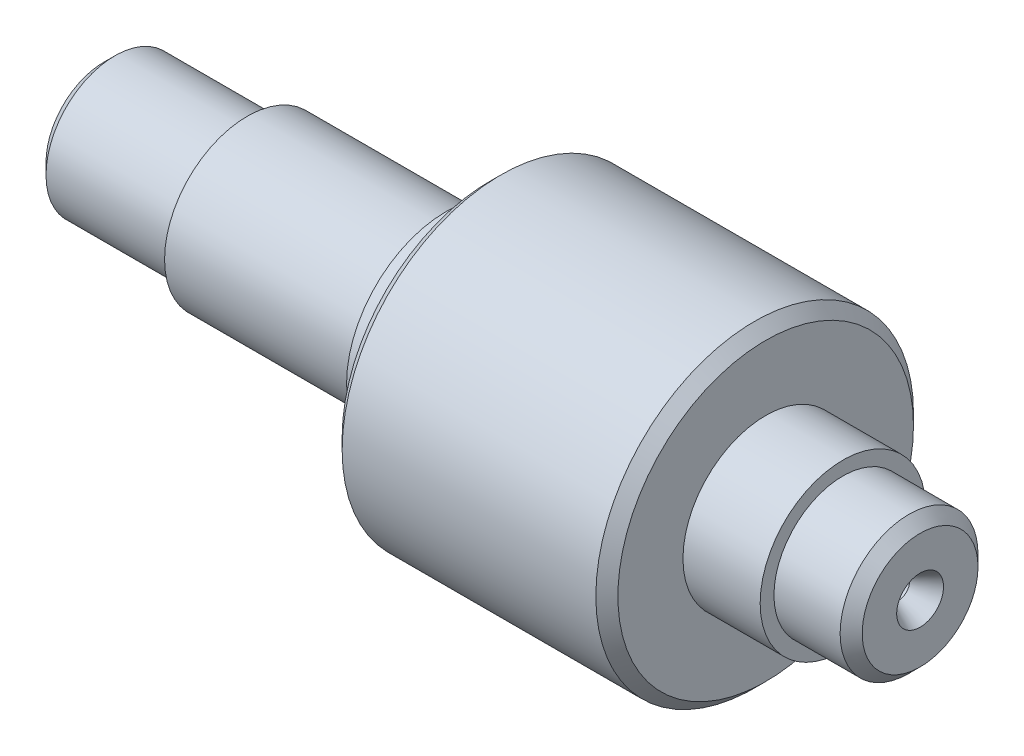
ISO-10303-21;
HEADER;
FILE_DESCRIPTION(('STEP AP214'),'2;1');
FILE_NAME('part.step','',(''),(''),'','','');
FILE_SCHEMA(('AUTOMOTIVE_DESIGN { 1 0 10303 214 1 1 1 1 }'));
ENDSEC;
DATA;
#1=APPLICATION_CONTEXT('core data for automotive mechanical design processes');
#2=APPLICATION_PROTOCOL_DEFINITION('international standard','automotive_design',2000,#1);
#3=PRODUCT_CONTEXT('',#1,'mechanical');
#4=PRODUCT('Part','Part','',(#3));
#5=PRODUCT_RELATED_PRODUCT_CATEGORY('part','',(#4));
#6=PRODUCT_DEFINITION_FORMATION('','',#4);
#7=PRODUCT_DEFINITION_CONTEXT('part definition',#1,'design');
#8=PRODUCT_DEFINITION('design','',#6,#7);
#9=PRODUCT_DEFINITION_SHAPE('','',#8);
#10=(LENGTH_UNIT() NAMED_UNIT(*) SI_UNIT(.MILLI.,.METRE.));
#11=(NAMED_UNIT(*) PLANE_ANGLE_UNIT() SI_UNIT($,.RADIAN.));
#12=(NAMED_UNIT(*) SI_UNIT($,.STERADIAN.) SOLID_ANGLE_UNIT());
#13=UNCERTAINTY_MEASURE_WITH_UNIT(LENGTH_MEASURE(1.E-05),#10,'distance_accuracy_value','');
#14=(GEOMETRIC_REPRESENTATION_CONTEXT(3) GLOBAL_UNCERTAINTY_ASSIGNED_CONTEXT((#13)) GLOBAL_UNIT_ASSIGNED_CONTEXT((#10,
#11,#12)) REPRESENTATION_CONTEXT('',''));
#15=CARTESIAN_POINT('',(0.,0.,0.));
#16=DIRECTION('',(0.,0.,1.));
#17=DIRECTION('',(1.,0.,0.));
#18=AXIS2_PLACEMENT_3D('',#15,#16,#17);
#19=CARTESIAN_POINT('',(0.,-12.5,0.));
#20=DIRECTION('',(-1.,0.,0.));
#21=DIRECTION('',(0.,0.,1.));
#22=AXIS2_PLACEMENT_3D('',#19,#20,#21);
#23=PLANE('',#22);
#24=CARTESIAN_POINT('',(0.,0.,0.));
#25=DIRECTION('',(-1.,0.,0.));
#26=DIRECTION('',(0.,0.,1.));
#27=AXIS2_PLACEMENT_3D('',#24,#25,#26);
#28=CIRCLE('',#27,10.5);
#29=CARTESIAN_POINT('',(0.,0.,10.5));
#30=VERTEX_POINT('',#29);
#31=EDGE_CURVE('E219',#30,#30,#28,.T.);
#32=ORIENTED_EDGE('',*,*,#31,.T.);
#33=EDGE_LOOP('',(#32));
#34=FACE_BOUND('',#33,.T.);
#35=CARTESIAN_POINT('',(0.,0.,0.));
#36=DIRECTION('',(-1.,0.,0.));
#37=DIRECTION('',(0.,0.,1.));
#38=AXIS2_PLACEMENT_3D('',#35,#36,#37);
#39=CIRCLE('',#38,4.25);
#40=CARTESIAN_POINT('',(0.,0.,4.25));
#41=VERTEX_POINT('',#40);
#42=EDGE_CURVE('E136',#41,#41,#39,.T.);
#43=ORIENTED_EDGE('',*,*,#42,.F.);
#44=EDGE_LOOP('',(#43));
#45=FACE_BOUND('',#44,.T.);
#46=ADVANCED_FACE('F40',(#34,#45),#23,.T.);
#47=CARTESIAN_POINT('',(148.,0.,0.));
#48=DIRECTION('',(1.,0.,0.));
#49=DIRECTION('',(0.,0.,-1.));
#50=AXIS2_PLACEMENT_3D('',#47,#48,#49);
#51=PLANE('',#50);
#52=CARTESIAN_POINT('',(148.,0.,0.));
#53=DIRECTION('',(1.,0.,0.));
#54=DIRECTION('',(0.,0.,-1.));
#55=AXIS2_PLACEMENT_3D('',#52,#53,#54);
#56=CIRCLE('',#55,10.5);
#57=CARTESIAN_POINT('',(148.,0.,-10.5));
#58=VERTEX_POINT('',#57);
#59=EDGE_CURVE('E11',#58,#58,#56,.T.);
#60=ORIENTED_EDGE('',*,*,#59,.T.);
#61=EDGE_LOOP('',(#60));
#62=FACE_BOUND('',#61,.T.);
#63=CARTESIAN_POINT('',(148.,0.,0.));
#64=DIRECTION('',(-1.,0.,0.));
#65=DIRECTION('',(0.,0.,1.));
#66=AXIS2_PLACEMENT_3D('',#63,#64,#65);
#67=CIRCLE('',#66,4.25);
#68=CARTESIAN_POINT('',(148.,0.,4.25));
#69=VERTEX_POINT('',#68);
#70=EDGE_CURVE('E119',#69,#69,#67,.T.);
#71=ORIENTED_EDGE('',*,*,#70,.T.);
#72=EDGE_LOOP('',(#71));
#73=FACE_BOUND('',#72,.T.);
#74=ADVANCED_FACE('F259',(#62,#73),#51,.T.);
#75=CARTESIAN_POINT('',(0.,0.,0.));
#76=DIRECTION('',(-1.,0.,0.));
#77=DIRECTION('',(0.,0.,1.));
#78=AXIS2_PLACEMENT_3D('',#75,#76,#77);
#79=CYLINDRICAL_SURFACE('',#78,12.5);
#80=CARTESIAN_POINT('',(146.,0.,0.));
#81=DIRECTION('',(1.,0.,0.));
#82=DIRECTION('',(0.,0.,-1.));
#83=AXIS2_PLACEMENT_3D('',#80,#81,#82);
#84=CIRCLE('',#83,12.5);
#85=CARTESIAN_POINT('',(146.,0.,-12.5));
#86=VERTEX_POINT('',#85);
#87=EDGE_CURVE('E50',#86,#86,#84,.F.);
#88=ORIENTED_EDGE('',*,*,#87,.T.);
#89=EDGE_LOOP('',(#88));
#90=FACE_BOUND('',#89,.T.);
#91=CARTESIAN_POINT('',(134.,0.,0.));
#92=DIRECTION('',(-1.,0.,0.));
#93=DIRECTION('',(0.,0.,1.));
#94=AXIS2_PLACEMENT_3D('',#91,#92,#93);
#95=CIRCLE('',#94,12.5);
#96=CARTESIAN_POINT('',(134.,0.,12.5));
#97=VERTEX_POINT('',#96);
#98=EDGE_CURVE('E176',#97,#97,#95,.T.);
#99=ORIENTED_EDGE('',*,*,#98,.F.);
#100=EDGE_LOOP('',(#99));
#101=FACE_BOUND('',#100,.T.);
#102=ADVANCED_FACE('F246',(#90,#101),#79,.T.);
#103=CARTESIAN_POINT('',(134.,-12.5,0.));
#104=DIRECTION('',(1.,0.,0.));
#105=DIRECTION('',(0.,0.,-1.));
#106=AXIS2_PLACEMENT_3D('',#103,#104,#105);
#107=PLANE('',#106);
#108=ORIENTED_EDGE('',*,*,#98,.T.);
#109=EDGE_LOOP('',(#108));
#110=FACE_BOUND('',#109,.T.);
#111=CARTESIAN_POINT('',(134.,0.,0.));
#112=DIRECTION('',(-1.,0.,0.));
#113=DIRECTION('',(0.,0.,1.));
#114=AXIS2_PLACEMENT_3D('',#111,#112,#113);
#115=CIRCLE('',#114,15.);
#116=CARTESIAN_POINT('',(134.,0.,15.));
#117=VERTEX_POINT('',#116);
#118=EDGE_CURVE('E172',#117,#117,#115,.T.);
#119=ORIENTED_EDGE('',*,*,#118,.F.);
#120=EDGE_LOOP('',(#119));
#121=FACE_BOUND('',#120,.T.);
#122=ADVANCED_FACE('F445',(#110,#121),#107,.T.);
#123=CARTESIAN_POINT('',(0.,0.,0.));
#124=DIRECTION('',(-1.,0.,0.));
#125=DIRECTION('',(0.,0.,1.));
#126=AXIS2_PLACEMENT_3D('',#123,#124,#125);
#127=CYLINDRICAL_SURFACE('',#126,15.);
#128=ORIENTED_EDGE('',*,*,#118,.T.);
#129=EDGE_LOOP('',(#128));
#130=FACE_BOUND('',#129,.T.);
#131=CARTESIAN_POINT('',(120.,0.,0.));
#132=DIRECTION('',(-1.,0.,0.));
#133=DIRECTION('',(0.,0.,1.));
#134=AXIS2_PLACEMENT_3D('',#131,#132,#133);
#135=CIRCLE('',#134,15.);
#136=CARTESIAN_POINT('',(120.,0.,15.));
#137=VERTEX_POINT('',#136);
#138=EDGE_CURVE('E168',#137,#137,#135,.T.);
#139=ORIENTED_EDGE('',*,*,#138,.F.);
#140=EDGE_LOOP('',(#139));
#141=FACE_BOUND('',#140,.T.);
#142=ADVANCED_FACE('F433',(#130,#141),#127,.T.);
#143=CARTESIAN_POINT('',(120.,-15.,0.));
#144=DIRECTION('',(1.,0.,0.));
#145=DIRECTION('',(0.,0.,-1.));
#146=AXIS2_PLACEMENT_3D('',#143,#144,#145);
#147=PLANE('',#146);
#148=CARTESIAN_POINT('',(120.,0.,0.));
#149=DIRECTION('',(1.,0.,0.));
#150=DIRECTION('',(0.,0.,-1.));
#151=AXIS2_PLACEMENT_3D('',#148,#149,#150);
#152=CIRCLE('',#151,26.8);
#153=CARTESIAN_POINT('',(120.,0.,-26.8));
#154=VERTEX_POINT('',#153);
#155=EDGE_CURVE('E239',#154,#154,#152,.T.);
#156=ORIENTED_EDGE('',*,*,#155,.T.);
#157=EDGE_LOOP('',(#156));
#158=FACE_BOUND('',#157,.T.);
#159=ORIENTED_EDGE('',*,*,#138,.T.);
#160=EDGE_LOOP('',(#159));
#161=FACE_BOUND('',#160,.T.);
#162=ADVANCED_FACE('F423',(#158,#161),#147,.T.);
#163=CARTESIAN_POINT('',(0.,0.,0.));
#164=DIRECTION('',(-1.,0.,0.));
#165=DIRECTION('',(0.,0.,1.));
#166=AXIS2_PLACEMENT_3D('',#163,#164,#165);
#167=CYLINDRICAL_SURFACE('',#166,28.8);
#168=CARTESIAN_POINT('',(72.,0.,0.));
#169=DIRECTION('',(-1.,0.,0.));
#170=DIRECTION('',(0.,0.,1.));
#171=AXIS2_PLACEMENT_3D('',#168,#169,#170);
#172=CIRCLE('',#171,28.8);
#173=CARTESIAN_POINT('',(72.,0.,28.8));
#174=VERTEX_POINT('',#173);
#175=EDGE_CURVE('E235',#174,#174,#172,.F.);
#176=ORIENTED_EDGE('',*,*,#175,.T.);
#177=EDGE_LOOP('',(#176));
#178=FACE_BOUND('',#177,.T.);
#179=CARTESIAN_POINT('',(118.,0.,0.));
#180=DIRECTION('',(1.,0.,0.));
#181=DIRECTION('',(0.,0.,-1.));
#182=AXIS2_PLACEMENT_3D('',#179,#180,#181);
#183=CIRCLE('',#182,28.8);
#184=CARTESIAN_POINT('',(118.,0.,-28.8));
#185=VERTEX_POINT('',#184);
#186=EDGE_CURVE('E231',#185,#185,#183,.F.);
#187=ORIENTED_EDGE('',*,*,#186,.T.);
#188=EDGE_LOOP('',(#187));
#189=FACE_BOUND('',#188,.T.);
#190=ADVANCED_FACE('F297',(#178,#189),#167,.T.);
#191=CARTESIAN_POINT('',(70.,-28.8,0.));
#192=DIRECTION('',(-1.,0.,0.));
#193=DIRECTION('',(0.,0.,1.));
#194=AXIS2_PLACEMENT_3D('',#191,#192,#193);
#195=PLANE('',#194);
#196=CARTESIAN_POINT('',(70.,0.,0.));
#197=DIRECTION('',(-1.,0.,0.));
#198=DIRECTION('',(0.,0.,1.));
#199=AXIS2_PLACEMENT_3D('',#196,#197,#198);
#200=CIRCLE('',#199,26.8);
#201=CARTESIAN_POINT('',(70.,0.,26.8));
#202=VERTEX_POINT('',#201);
#203=EDGE_CURVE('E227',#202,#202,#200,.T.);
#204=ORIENTED_EDGE('',*,*,#203,.T.);
#205=EDGE_LOOP('',(#204));
#206=FACE_BOUND('',#205,.T.);
#207=CARTESIAN_POINT('',(70.,0.,0.));
#208=DIRECTION('',(-1.,0.,0.));
#209=DIRECTION('',(0.,0.,1.));
#210=AXIS2_PLACEMENT_3D('',#207,#208,#209);
#211=CIRCLE('',#210,18.);
#212=CARTESIAN_POINT('',(70.,0.,18.));
#213=VERTEX_POINT('',#212);
#214=EDGE_CURVE('E164',#213,#213,#211,.T.);
#215=ORIENTED_EDGE('',*,*,#214,.F.);
#216=EDGE_LOOP('',(#215));
#217=FACE_BOUND('',#216,.T.);
#218=ADVANCED_FACE('F293',(#206,#217),#195,.T.);
#219=CARTESIAN_POINT('',(0.,0.,0.));
#220=DIRECTION('',(-1.,0.,0.));
#221=DIRECTION('',(0.,0.,1.));
#222=AXIS2_PLACEMENT_3D('',#219,#220,#221);
#223=CYLINDRICAL_SURFACE('',#222,18.);
#224=ORIENTED_EDGE('',*,*,#214,.T.);
#225=EDGE_LOOP('',(#224));
#226=FACE_BOUND('',#225,.T.);
#227=CARTESIAN_POINT('',(62.,0.,0.));
#228=DIRECTION('',(-1.,0.,0.));
#229=DIRECTION('',(0.,0.,1.));
#230=AXIS2_PLACEMENT_3D('',#227,#228,#229);
#231=CIRCLE('',#230,18.);
#232=CARTESIAN_POINT('',(62.,0.,18.));
#233=VERTEX_POINT('',#232);
#234=EDGE_CURVE('E160',#233,#233,#231,.T.);
#235=ORIENTED_EDGE('',*,*,#234,.F.);
#236=EDGE_LOOP('',(#235));
#237=FACE_BOUND('',#236,.T.);
#238=ADVANCED_FACE('F296',(#226,#237),#223,.T.);
#239=CARTESIAN_POINT('',(62.,-18.,0.));
#240=DIRECTION('',(-1.,0.,0.));
#241=DIRECTION('',(0.,0.,1.));
#242=AXIS2_PLACEMENT_3D('',#239,#240,#241);
#243=PLANE('',#242);
#244=ORIENTED_EDGE('',*,*,#234,.T.);
#245=EDGE_LOOP('',(#244));
#246=FACE_BOUND('',#245,.T.);
#247=CARTESIAN_POINT('',(62.,0.,0.));
#248=DIRECTION('',(-1.,0.,0.));
#249=DIRECTION('',(0.,0.,1.));
#250=AXIS2_PLACEMENT_3D('',#247,#248,#249);
#251=CIRCLE('',#250,15.);
#252=CARTESIAN_POINT('',(62.,0.,15.));
#253=VERTEX_POINT('',#252);
#254=EDGE_CURVE('E156',#253,#253,#251,.T.);
#255=ORIENTED_EDGE('',*,*,#254,.F.);
#256=EDGE_LOOP('',(#255));
#257=FACE_BOUND('',#256,.T.);
#258=ADVANCED_FACE('F303',(#246,#257),#243,.T.);
#259=CARTESIAN_POINT('',(0.,0.,0.));
#260=DIRECTION('',(-1.,0.,0.));
#261=DIRECTION('',(0.,0.,1.));
#262=AXIS2_PLACEMENT_3D('',#259,#260,#261);
#263=CYLINDRICAL_SURFACE('',#262,15.);
#264=CARTESIAN_POINT('',(37.,-4.,-14.456832294801));
#265=CARTESIAN_POINT('',(36.8896417565959,-4.00001309389174,-14.4568189842467));
#266=CARTESIAN_POINT('',(36.7792914780071,-3.99543311151603,-14.4580956467717));
#267=CARTESIAN_POINT('',(36.5594213460339,-3.97718874589725,-14.4631301353517));
#268=CARTESIAN_POINT('',(36.4499013422403,-3.96352604983924,-14.4668875005959));
#269=CARTESIAN_POINT('',(36.232698346486,-3.92725695741263,-14.4767740441059));
#270=CARTESIAN_POINT('',(36.1250119121517,-3.90466984692446,-14.482898107258));
#271=CARTESIAN_POINT('',(35.9120251396443,-3.85076543838184,-14.4973231400467));
#272=CARTESIAN_POINT('',(35.8067248434147,-3.81944798699437,-14.5056241479174));
#273=CARTESIAN_POINT('',(35.4955365812247,-3.71275643853686,-14.5334412456827));
#274=CARTESIAN_POINT('',(35.2941250664526,-3.62460332607936,-14.5558829598252));
#275=CARTESIAN_POINT('',(34.9089792403742,-3.4169578047582,-14.6060171290377));
#276=CARTESIAN_POINT('',(34.7252507960276,-3.29745504324306,-14.6337113178035));
#277=CARTESIAN_POINT('',(34.3760294230722,-3.0273032087801,-14.6920016406366));
#278=CARTESIAN_POINT('',(34.2110381590343,-2.87601544465619,-14.7226489452442));
#279=CARTESIAN_POINT('',(33.9084424330384,-2.54795832924029,-14.7829523618628));
#280=CARTESIAN_POINT('',(33.7708424171316,-2.37118484921249,-14.8126083123117));
#281=CARTESIAN_POINT('',(33.5248278698145,-1.99367199592156,-14.8681604116921));
#282=CARTESIAN_POINT('',(33.4169160344217,-1.79259414843396,-14.8939887414057));
#283=CARTESIAN_POINT('',(33.2366271110387,-1.37435575552791,-14.9383834129136));
#284=CARTESIAN_POINT('',(33.1642423552231,-1.15719869214847,-14.9569513215518));
#285=CARTESIAN_POINT('',(33.0586901748307,-0.718234307369676,-14.9843709217852));
#286=CARTESIAN_POINT('',(33.0246627871064,-0.496647293428111,-14.9934353394138));
#287=CARTESIAN_POINT('',(32.994085686777,-0.0507319917605809,-15.0015705103632));
#288=CARTESIAN_POINT('',(32.9975305158075,0.173595891963453,-15.0006427191926));
#289=CARTESIAN_POINT('',(33.0411956863681,0.612629502642169,-14.9890534931377));
#290=CARTESIAN_POINT('',(33.0804861276563,0.827435206418323,-14.9786381919443));
#291=CARTESIAN_POINT('',(33.1932251508632,1.24728467665105,-14.9495347795913));
#292=CARTESIAN_POINT('',(33.2666753521507,1.45232797980575,-14.9308462762364));
#293=CARTESIAN_POINT('',(33.4463599662528,1.84920963545355,-14.8869312076945));
#294=CARTESIAN_POINT('',(33.5529133722298,2.04089626466617,-14.8616414267933));
#295=CARTESIAN_POINT('',(33.7955427689646,2.40398441957148,-14.8072486052897));
#296=CARTESIAN_POINT('',(33.9316239221831,2.5753823900035,-14.7781448982353));
#297=CARTESIAN_POINT('',(34.2343279711014,2.8985493503678,-14.7182294237973));
#298=CARTESIAN_POINT('',(34.4017580078943,3.04955722400809,-14.6873926412644));
#299=CARTESIAN_POINT('',(34.7600428407092,3.32161448391783,-14.6282716207252));
#300=CARTESIAN_POINT('',(34.9509040964812,3.4426555807802,-14.5999880903709));
#301=CARTESIAN_POINT('',(35.2513532833646,3.59932937334133,-14.5618587427771));
#302=CARTESIAN_POINT('',(35.354288915041,3.64754371945348,-14.5498268172621));
#303=CARTESIAN_POINT('',(35.5640463212715,3.73509417643326,-14.5275984074125));
#304=CARTESIAN_POINT('',(35.6708665124627,3.77443385857864,-14.5174011851057));
#305=CARTESIAN_POINT('',(35.8875194192202,3.843867838105,-14.4991713081511));
#306=CARTESIAN_POINT('',(35.997348878193,3.87397173088604,-14.4911364080612));
#307=CARTESIAN_POINT('',(36.2192752211249,3.92471856960774,-14.4774747012191));
#308=CARTESIAN_POINT('',(36.33137102282,3.9453659249532,-14.4718467722231));
#309=CARTESIAN_POINT('',(36.536251024718,3.97411378733402,-14.4639761334309));
#310=CARTESIAN_POINT('',(36.6287964461673,3.98382319960777,-14.4613012625133));
#311=CARTESIAN_POINT('',(36.8142253533099,3.99676420153356,-14.4577275048596));
#312=CARTESIAN_POINT('',(36.9071080704325,4.00000603663184,-14.4568258092259));
#313=CARTESIAN_POINT('',(37.,4.,-14.456832294801));
#314=B_SPLINE_CURVE_WITH_KNOTS('',3,(#264,#265,#266,#267,#268,#269,#270,#271,#272,#273,#274,
#275,#276,#277,#278,#279,#280,#281,#282,#283,#284,#285,#286,#287,#288,#289,#290,#291,#292,#293,
#294,#295,#296,#297,#298,#299,#300,#301,#302,#303,#304,#305,#306,#307,#308,#309,#310,#311,#312,
#313),.UNSPECIFIED.,.F.,.F.,(4,2,2,2,2,2,2,2,2,2,2,2,2,2,2,2,2,2,2,2,2,2,2,2,4),(0.,
0.330958670878044,0.66185588076851,0.992041890688588,1.32223370010825,1.98190700187181,
2.64179842357632,3.3164963753615,3.99130375261118,4.67691814590523,5.3623844975935,
6.03215661862343,6.7018311790669,7.35461236515045,8.00742449996358,8.66673340793703,
9.32615767867957,10.0057598785669,10.6855498604333,11.0281077435251,11.3705275300852,
11.7125903499582,12.0544935096114,12.3335333037377,12.6121307120356),.UNSPECIFIED.);
#315=CARTESIAN_POINT('',(37.,-4.,-14.456832294801));
#316=VERTEX_POINT('',#315);
#317=CARTESIAN_POINT('',(37.,4.,-14.456832294801));
#318=VERTEX_POINT('',#317);
#319=EDGE_CURVE('E212',#316,#318,#314,.T.);
#320=ORIENTED_EDGE('',*,*,#319,.F.);
#321=DIRECTION('',(-1.,0.,0.));
#322=VECTOR('',#321,1.);
#323=CARTESIAN_POINT('',(0.,-4.00000000000001,-14.456832294801));
#324=LINE('',#323,#322);
#325=CARTESIAN_POINT('',(51.,-4.00000000000001,-14.456832294801));
#326=VERTEX_POINT('',#325);
#327=EDGE_CURVE('E89',#326,#316,#324,.T.);
#328=ORIENTED_EDGE('',*,*,#327,.F.);
#329=CARTESIAN_POINT('',(51.,4.,-14.456832294801));
#330=CARTESIAN_POINT('',(51.1103582434041,4.00001309389174,-14.4568189842467));
#331=CARTESIAN_POINT('',(51.2207085219929,3.99543311151603,-14.4580956467717));
#332=CARTESIAN_POINT('',(51.4405786539661,3.97718874589726,-14.4631301353517));
#333=CARTESIAN_POINT('',(51.5500986577597,3.96352604983924,-14.4668875005959));
#334=CARTESIAN_POINT('',(51.767301653514,3.92725695741263,-14.4767740441058));
#335=CARTESIAN_POINT('',(51.8749880878483,3.90466984692446,-14.482898107258));
#336=CARTESIAN_POINT('',(52.0879748603556,3.85076543838184,-14.4973231400467));
#337=CARTESIAN_POINT('',(52.1932751565853,3.81944798699437,-14.5056241479174));
#338=CARTESIAN_POINT('',(52.5044634187753,3.71275643853687,-14.5334412456827));
#339=CARTESIAN_POINT('',(52.7058749335474,3.62460332607936,-14.5558829598252));
#340=CARTESIAN_POINT('',(53.0910207596258,3.4169578047582,-14.6060171290377));
#341=CARTESIAN_POINT('',(53.2747492039724,3.29745504324307,-14.6337113178035));
#342=CARTESIAN_POINT('',(53.6239705769278,3.0273032087801,-14.6920016406366));
#343=CARTESIAN_POINT('',(53.7889618409657,2.87601544465619,-14.7226489452442));
#344=CARTESIAN_POINT('',(54.0915575669616,2.54795832924029,-14.7829523618628));
#345=CARTESIAN_POINT('',(54.2291575828684,2.37118484921249,-14.8126083123117));
#346=CARTESIAN_POINT('',(54.4751721301854,1.99367199592156,-14.8681604116921));
#347=CARTESIAN_POINT('',(54.5830839655783,1.79259414843397,-14.8939887414057));
#348=CARTESIAN_POINT('',(54.7633728889612,1.37435575552791,-14.9383834129136));
#349=CARTESIAN_POINT('',(54.8357576447769,1.15719869214847,-14.9569513215518));
#350=CARTESIAN_POINT('',(54.9413098251693,0.718234307369679,-14.9843709217852));
#351=CARTESIAN_POINT('',(54.9753372128936,0.496647293428113,-14.9934353394138));
#352=CARTESIAN_POINT('',(55.005914313223,0.050731991760583,-15.0015705103632));
#353=CARTESIAN_POINT('',(55.0024694841925,-0.173595891963451,-15.0006427191926));
#354=CARTESIAN_POINT('',(54.9588043136319,-0.612629502642167,-14.9890534931377));
#355=CARTESIAN_POINT('',(54.9195138723437,-0.827435206418321,-14.9786381919443));
#356=CARTESIAN_POINT('',(54.8067748491367,-1.24728467665105,-14.9495347795913));
#357=CARTESIAN_POINT('',(54.7333246478493,-1.45232797980575,-14.9308462762364));
#358=CARTESIAN_POINT('',(54.5536400337472,-1.84920963545355,-14.8869312076945));
#359=CARTESIAN_POINT('',(54.4470866277702,-2.04089626466617,-14.8616414267933));
#360=CARTESIAN_POINT('',(54.2044572310354,-2.40398441957148,-14.8072486052897));
#361=CARTESIAN_POINT('',(54.0683760778169,-2.5753823900035,-14.7781448982353));
#362=CARTESIAN_POINT('',(53.7656720288986,-2.8985493503678,-14.7182294237973));
#363=CARTESIAN_POINT('',(53.5982419921057,-3.04955722400808,-14.6873926412644));
#364=CARTESIAN_POINT('',(53.2399571592908,-3.32161448391782,-14.6282716207252));
#365=CARTESIAN_POINT('',(53.0490959035188,-3.4426555807802,-14.5999880903709));
#366=CARTESIAN_POINT('',(52.7486467166354,-3.59932937334133,-14.5618587427771));
#367=CARTESIAN_POINT('',(52.645711084959,-3.64754371945347,-14.5498268172621));
#368=CARTESIAN_POINT('',(52.4359536787285,-3.73509417643326,-14.5275984074125));
#369=CARTESIAN_POINT('',(52.3291334875373,-3.77443385857863,-14.5174011851057));
#370=CARTESIAN_POINT('',(52.1124805807798,-3.843867838105,-14.4991713081511));
#371=CARTESIAN_POINT('',(52.002651121807,-3.87397173088603,-14.4911364080612));
#372=CARTESIAN_POINT('',(51.780724778875,-3.92471856960774,-14.4774747012191));
#373=CARTESIAN_POINT('',(51.66862897718,-3.9453659249532,-14.4718467722231));
#374=CARTESIAN_POINT('',(51.463748975282,-3.97411378733402,-14.4639761334309));
#375=CARTESIAN_POINT('',(51.3712035538327,-3.98382319960776,-14.4613012625133));
#376=CARTESIAN_POINT('',(51.1857746466901,-3.99676420153355,-14.4577275048596));
#377=CARTESIAN_POINT('',(51.0928919295675,-4.00000603663183,-14.4568258092259));
#378=CARTESIAN_POINT('',(51.,-4.,-14.456832294801));
#379=B_SPLINE_CURVE_WITH_KNOTS('',3,(#329,#330,#331,#332,#333,#334,#335,#336,#337,#338,#339,
#340,#341,#342,#343,#344,#345,#346,#347,#348,#349,#350,#351,#352,#353,#354,#355,#356,#357,#358,
#359,#360,#361,#362,#363,#364,#365,#366,#367,#368,#369,#370,#371,#372,#373,#374,#375,#376,#377,
#378),.UNSPECIFIED.,.F.,.F.,(4,2,2,2,2,2,2,2,2,2,2,2,2,2,2,2,2,2,2,2,2,2,2,2,4),(0.,
0.330958670878051,0.66185588076851,0.992041890688574,1.32223370010825,1.98190700187181,
2.64179842357632,3.3164963753615,3.99130375261118,4.67691814590523,5.3623844975935,
6.03215661862343,6.7018311790669,7.35461236515045,8.00742449996358,8.66673340793703,
9.32615767867957,10.0057598785669,10.6855498604333,11.0281077435251,11.3705275300852,
11.7125903499582,12.0544935096114,12.3335333037377,12.6121307120356),.UNSPECIFIED.);
#380=CARTESIAN_POINT('',(51.,4.,-14.456832294801));
#381=VERTEX_POINT('',#380);
#382=EDGE_CURVE('E182',#381,#326,#379,.T.);
#383=ORIENTED_EDGE('',*,*,#382,.F.);
#384=DIRECTION('',(-1.,0.,0.));
#385=VECTOR('',#384,1.);
#386=CARTESIAN_POINT('',(0.,3.99999999999999,-14.456832294801));
#387=LINE('',#386,#385);
#388=EDGE_CURVE('E191',#318,#381,#387,.F.);
#389=ORIENTED_EDGE('',*,*,#388,.F.);
#390=EDGE_LOOP('',(#320,#328,#383,#389));
#391=FACE_BOUND('',#390,.T.);
#392=ORIENTED_EDGE('',*,*,#254,.T.);
#393=EDGE_LOOP('',(#392));
#394=FACE_BOUND('',#393,.T.);
#395=CARTESIAN_POINT('',(26.,0.,0.));
#396=DIRECTION('',(-1.,0.,0.));
#397=DIRECTION('',(0.,0.,1.));
#398=AXIS2_PLACEMENT_3D('',#395,#396,#397);
#399=CIRCLE('',#398,15.);
#400=CARTESIAN_POINT('',(26.,0.,15.));
#401=VERTEX_POINT('',#400);
#402=EDGE_CURVE('E152',#401,#401,#399,.T.);
#403=ORIENTED_EDGE('',*,*,#402,.F.);
#404=EDGE_LOOP('',(#403));
#405=FACE_BOUND('',#404,.T.);
#406=ADVANCED_FACE('F193',(#391,#394,#405),#263,.T.);
#407=CARTESIAN_POINT('',(26.,-15.,0.));
#408=DIRECTION('',(-1.,0.,0.));
#409=DIRECTION('',(0.,0.,1.));
#410=AXIS2_PLACEMENT_3D('',#407,#408,#409);
#411=PLANE('',#410);
#412=ORIENTED_EDGE('',*,*,#402,.T.);
#413=EDGE_LOOP('',(#412));
#414=FACE_BOUND('',#413,.T.);
#415=CARTESIAN_POINT('',(26.,0.,0.));
#416=DIRECTION('',(-1.,0.,0.));
#417=DIRECTION('',(0.,0.,1.));
#418=AXIS2_PLACEMENT_3D('',#415,#416,#417);
#419=CIRCLE('',#418,12.5);
#420=CARTESIAN_POINT('',(26.,0.,12.5));
#421=VERTEX_POINT('',#420);
#422=EDGE_CURVE('E148',#421,#421,#419,.T.);
#423=ORIENTED_EDGE('',*,*,#422,.F.);
#424=EDGE_LOOP('',(#423));
#425=FACE_BOUND('',#424,.T.);
#426=ADVANCED_FACE('F313',(#414,#425),#411,.T.);
#427=CARTESIAN_POINT('',(0.,0.,0.));
#428=DIRECTION('',(-1.,0.,0.));
#429=DIRECTION('',(0.,0.,1.));
#430=AXIS2_PLACEMENT_3D('',#427,#428,#429);
#431=CYLINDRICAL_SURFACE('',#430,12.5);
#432=CARTESIAN_POINT('',(2.00000000000001,0.,0.));
#433=DIRECTION('',(-1.,0.,0.));
#434=DIRECTION('',(0.,0.,1.));
#435=AXIS2_PLACEMENT_3D('',#432,#433,#434);
#436=CIRCLE('',#435,12.5);
#437=CARTESIAN_POINT('',(2.00000000000001,0.,12.5));
#438=VERTEX_POINT('',#437);
#439=EDGE_CURVE('E223',#438,#438,#436,.F.);
#440=ORIENTED_EDGE('',*,*,#439,.T.);
#441=EDGE_LOOP('',(#440));
#442=FACE_BOUND('',#441,.T.);
#443=ORIENTED_EDGE('',*,*,#422,.T.);
#444=EDGE_LOOP('',(#443));
#445=FACE_BOUND('',#444,.T.);
#446=ADVANCED_FACE('F319',(#442,#445),#431,.T.);
#447=CARTESIAN_POINT('',(10.0547005383793,0.,0.));
#448=DIRECTION('',(-1.,0.,0.));
#449=DIRECTION('',(0.,0.,1.));
#450=AXIS2_PLACEMENT_3D('',#447,#448,#449);
#451=CONICAL_SURFACE('',#450,0.,1.04719755119659);
#452=CARTESIAN_POINT('',(8.9,0.,0.));
#453=DIRECTION('',(-1.,0.,0.));
#454=DIRECTION('',(0.,0.,1.));
#455=AXIS2_PLACEMENT_3D('',#452,#453,#454);
#456=CIRCLE('',#455,2.);
#457=CARTESIAN_POINT('',(8.9,0.,2.));
#458=VERTEX_POINT('',#457);
#459=EDGE_CURVE('E144',#458,#458,#456,.T.);
#460=ORIENTED_EDGE('',*,*,#459,.T.);
#461=EDGE_LOOP('',(#460));
#462=FACE_BOUND('',#461,.T.);
#463=CARTESIAN_POINT('',(10.0547005383793,0.,0.));
#464=VERTEX_POINT('',#463);
#465=VERTEX_LOOP('',#464);
#466=FACE_BOUND('',#465,.T.);
#467=ADVANCED_FACE('F323',(#462,#466),#451,.F.);
#468=CARTESIAN_POINT('',(0.,0.,0.));
#469=DIRECTION('',(-1.,0.,0.));
#470=DIRECTION('',(0.,0.,1.));
#471=AXIS2_PLACEMENT_3D('',#468,#469,#470);
#472=CYLINDRICAL_SURFACE('',#471,2.);
#473=CARTESIAN_POINT('',(3.9,0.,0.));
#474=DIRECTION('',(-1.,0.,0.));
#475=DIRECTION('',(0.,0.,1.));
#476=AXIS2_PLACEMENT_3D('',#473,#474,#475);
#477=CIRCLE('',#476,2.);
#478=CARTESIAN_POINT('',(3.9,0.,2.));
#479=VERTEX_POINT('',#478);
#480=EDGE_CURVE('E140',#479,#479,#477,.T.);
#481=ORIENTED_EDGE('',*,*,#480,.T.);
#482=EDGE_LOOP('',(#481));
#483=FACE_BOUND('',#482,.T.);
#484=ORIENTED_EDGE('',*,*,#459,.F.);
#485=EDGE_LOOP('',(#484));
#486=FACE_BOUND('',#485,.T.);
#487=ADVANCED_FACE('F329',(#483,#486),#472,.F.);
#488=CARTESIAN_POINT('',(3.9,0.,0.));
#489=DIRECTION('',(-1.,0.,0.));
#490=DIRECTION('',(0.,0.,1.));
#491=AXIS2_PLACEMENT_3D('',#488,#489,#490);
#492=CONICAL_SURFACE('',#491,2.,0.523278322131976);
#493=ORIENTED_EDGE('',*,*,#42,.T.);
#494=EDGE_LOOP('',(#493));
#495=FACE_BOUND('',#494,.T.);
#496=ORIENTED_EDGE('',*,*,#480,.F.);
#497=EDGE_LOOP('',(#496));
#498=FACE_BOUND('',#497,.T.);
#499=ADVANCED_FACE('F335',(#495,#498),#492,.F.);
#500=CARTESIAN_POINT('',(137.945299461621,0.,0.));
#501=DIRECTION('',(1.,0.,0.));
#502=DIRECTION('',(0.,0.,1.));
#503=AXIS2_PLACEMENT_3D('',#500,#501,#502);
#504=CONICAL_SURFACE('',#503,0.,1.04719755119659);
#505=CARTESIAN_POINT('',(139.1,0.,0.));
#506=DIRECTION('',(-1.,0.,0.));
#507=DIRECTION('',(0.,0.,1.));
#508=AXIS2_PLACEMENT_3D('',#505,#506,#507);
#509=CIRCLE('',#508,2.);
#510=CARTESIAN_POINT('',(139.1,0.,2.));
#511=VERTEX_POINT('',#510);
#512=EDGE_CURVE('E132',#511,#511,#509,.T.);
#513=ORIENTED_EDGE('',*,*,#512,.F.);
#514=EDGE_LOOP('',(#513));
#515=FACE_BOUND('',#514,.T.);
#516=CARTESIAN_POINT('',(137.945299461621,0.,0.));
#517=VERTEX_POINT('',#516);
#518=VERTEX_LOOP('',#517);
#519=FACE_BOUND('',#518,.T.);
#520=ADVANCED_FACE('F339',(#515,#519),#504,.F.);
#521=CARTESIAN_POINT('',(148.,0.,0.));
#522=DIRECTION('',(1.,0.,0.));
#523=DIRECTION('',(0.,0.,1.));
#524=AXIS2_PLACEMENT_3D('',#521,#522,#523);
#525=CYLINDRICAL_SURFACE('',#524,2.);
#526=CARTESIAN_POINT('',(144.1,0.,0.));
#527=DIRECTION('',(-1.,0.,0.));
#528=DIRECTION('',(0.,0.,1.));
#529=AXIS2_PLACEMENT_3D('',#526,#527,#528);
#530=CIRCLE('',#529,2.);
#531=CARTESIAN_POINT('',(144.1,0.,2.));
#532=VERTEX_POINT('',#531);
#533=EDGE_CURVE('E128',#532,#532,#530,.T.);
#534=ORIENTED_EDGE('',*,*,#533,.F.);
#535=EDGE_LOOP('',(#534));
#536=FACE_BOUND('',#535,.T.);
#537=ORIENTED_EDGE('',*,*,#512,.T.);
#538=EDGE_LOOP('',(#537));
#539=FACE_BOUND('',#538,.T.);
#540=ADVANCED_FACE('F342',(#536,#539),#525,.F.);
#541=CARTESIAN_POINT('',(144.1,0.,0.));
#542=DIRECTION('',(1.,0.,0.));
#543=DIRECTION('',(0.,0.,1.));
#544=AXIS2_PLACEMENT_3D('',#541,#542,#543);
#545=CONICAL_SURFACE('',#544,2.,0.523278322131976);
#546=ORIENTED_EDGE('',*,*,#70,.F.);
#547=EDGE_LOOP('',(#546));
#548=FACE_BOUND('',#547,.T.);
#549=ORIENTED_EDGE('',*,*,#533,.T.);
#550=EDGE_LOOP('',(#549));
#551=FACE_BOUND('',#550,.T.);
#552=ADVANCED_FACE('F210',(#548,#551),#545,.F.);
#553=CARTESIAN_POINT('',(37.,0.,-20.));
#554=DIRECTION('',(0.,0.,1.));
#555=DIRECTION('',(1.,0.,0.));
#556=AXIS2_PLACEMENT_3D('',#553,#554,#555);
#557=CYLINDRICAL_SURFACE('',#556,4.);
#558=ORIENTED_EDGE('',*,*,#319,.T.);
#559=DIRECTION('',(0.,0.,1.));
#560=VECTOR('',#559,1.);
#561=CARTESIAN_POINT('',(37.,4.,-20.));
#562=LINE('',#561,#560);
#563=CARTESIAN_POINT('',(37.,4.,-10.));
#564=VERTEX_POINT('',#563);
#565=EDGE_CURVE('E109',#318,#564,#562,.T.);
#566=ORIENTED_EDGE('',*,*,#565,.T.);
#567=CARTESIAN_POINT('',(37.,0.,-10.));
#568=DIRECTION('',(0.,0.,1.));
#569=DIRECTION('',(1.,0.,0.));
#570=AXIS2_PLACEMENT_3D('',#567,#568,#569);
#571=CIRCLE('',#570,4.);
#572=CARTESIAN_POINT('',(37.,-4.,-10.));
#573=VERTEX_POINT('',#572);
#574=EDGE_CURVE('E101',#564,#573,#571,.T.);
#575=ORIENTED_EDGE('',*,*,#574,.T.);
#576=DIRECTION('',(0.,0.,1.));
#577=VECTOR('',#576,1.);
#578=CARTESIAN_POINT('',(37.,-4.,-20.));
#579=LINE('',#578,#577);
#580=EDGE_CURVE('E84',#316,#573,#579,.T.);
#581=ORIENTED_EDGE('',*,*,#580,.F.);
#582=EDGE_LOOP('',(#558,#566,#575,#581));
#583=FACE_BOUND('',#582,.T.);
#584=ADVANCED_FACE('F107',(#583),#557,.F.);
#585=CARTESIAN_POINT('',(37.,4.,-20.));
#586=DIRECTION('',(0.,1.,0.));
#587=DIRECTION('',(-1.,0.,0.));
#588=AXIS2_PLACEMENT_3D('',#585,#586,#587);
#589=PLANE('',#588);
#590=ORIENTED_EDGE('',*,*,#388,.T.);
#591=DIRECTION('',(0.,0.,1.));
#592=VECTOR('',#591,1.);
#593=CARTESIAN_POINT('',(51.,4.,-20.));
#594=LINE('',#593,#592);
#595=CARTESIAN_POINT('',(51.,4.,-10.));
#596=VERTEX_POINT('',#595);
#597=EDGE_CURVE('E120',#381,#596,#594,.T.);
#598=ORIENTED_EDGE('',*,*,#597,.T.);
#599=DIRECTION('',(-1.,0.,0.));
#600=VECTOR('',#599,1.);
#601=CARTESIAN_POINT('',(37.,4.,-10.));
#602=LINE('',#601,#600);
#603=EDGE_CURVE('E94',#596,#564,#602,.T.);
#604=ORIENTED_EDGE('',*,*,#603,.T.);
#605=ORIENTED_EDGE('',*,*,#565,.F.);
#606=EDGE_LOOP('',(#590,#598,#604,#605));
#607=FACE_BOUND('',#606,.T.);
#608=ADVANCED_FACE('F202',(#607),#589,.F.);
#609=CARTESIAN_POINT('',(51.,0.,-20.));
#610=DIRECTION('',(0.,0.,1.));
#611=DIRECTION('',(1.,0.,0.));
#612=AXIS2_PLACEMENT_3D('',#609,#610,#611);
#613=CYLINDRICAL_SURFACE('',#612,4.);
#614=ORIENTED_EDGE('',*,*,#382,.T.);
#615=DIRECTION('',(0.,0.,1.));
#616=VECTOR('',#615,1.);
#617=CARTESIAN_POINT('',(51.,-4.,-20.));
#618=LINE('',#617,#616);
#619=CARTESIAN_POINT('',(51.,-4.,-10.));
#620=VERTEX_POINT('',#619);
#621=EDGE_CURVE('E57',#326,#620,#618,.T.);
#622=ORIENTED_EDGE('',*,*,#621,.T.);
#623=CARTESIAN_POINT('',(51.,0.,-10.));
#624=DIRECTION('',(0.,0.,1.));
#625=DIRECTION('',(1.,0.,0.));
#626=AXIS2_PLACEMENT_3D('',#623,#624,#625);
#627=CIRCLE('',#626,4.);
#628=EDGE_CURVE('E104',#620,#596,#627,.T.);
#629=ORIENTED_EDGE('',*,*,#628,.T.);
#630=ORIENTED_EDGE('',*,*,#597,.F.);
#631=EDGE_LOOP('',(#614,#622,#629,#630));
#632=FACE_BOUND('',#631,.T.);
#633=ADVANCED_FACE('F197',(#632),#613,.F.);
#634=CARTESIAN_POINT('',(37.,-4.,-20.));
#635=DIRECTION('',(0.,-1.,0.));
#636=DIRECTION('',(1.,0.,0.));
#637=AXIS2_PLACEMENT_3D('',#634,#635,#636);
#638=PLANE('',#637);
#639=ORIENTED_EDGE('',*,*,#327,.T.);
#640=ORIENTED_EDGE('',*,*,#580,.T.);
#641=DIRECTION('',(1.,0.,0.));
#642=VECTOR('',#641,1.);
#643=CARTESIAN_POINT('',(37.,-4.,-10.));
#644=LINE('',#643,#642);
#645=EDGE_CURVE('E87',#573,#620,#644,.T.);
#646=ORIENTED_EDGE('',*,*,#645,.T.);
#647=ORIENTED_EDGE('',*,*,#621,.F.);
#648=EDGE_LOOP('',(#639,#640,#646,#647));
#649=FACE_BOUND('',#648,.T.);
#650=ADVANCED_FACE('F86',(#649),#638,.F.);
#651=CARTESIAN_POINT('',(37.,0.,-10.));
#652=DIRECTION('',(0.,0.,1.));
#653=DIRECTION('',(1.,0.,0.));
#654=AXIS2_PLACEMENT_3D('',#651,#652,#653);
#655=PLANE('',#654);
#656=ORIENTED_EDGE('',*,*,#574,.F.);
#657=ORIENTED_EDGE('',*,*,#603,.F.);
#658=ORIENTED_EDGE('',*,*,#628,.F.);
#659=ORIENTED_EDGE('',*,*,#645,.F.);
#660=EDGE_LOOP('',(#656,#657,#658,#659));
#661=FACE_BOUND('',#660,.T.);
#662=ADVANCED_FACE('F99',(#661),#655,.F.);
#663=CARTESIAN_POINT('',(0.,0.,0.));
#664=DIRECTION('',(1.,0.,0.));
#665=DIRECTION('',(0.,0.,-1.));
#666=AXIS2_PLACEMENT_3D('',#663,#664,#665);
#667=CONICAL_SURFACE('',#666,10.5,0.785398163397444);
#668=ORIENTED_EDGE('',*,*,#439,.F.);
#669=EDGE_LOOP('',(#668));
#670=FACE_BOUND('',#669,.T.);
#671=ORIENTED_EDGE('',*,*,#31,.F.);
#672=EDGE_LOOP('',(#671));
#673=FACE_BOUND('',#672,.T.);
#674=ADVANCED_FACE('F271',(#670,#673),#667,.T.);
#675=CARTESIAN_POINT('',(70.,0.,0.));
#676=DIRECTION('',(1.,0.,0.));
#677=DIRECTION('',(0.,0.,-1.));
#678=AXIS2_PLACEMENT_3D('',#675,#676,#677);
#679=CONICAL_SURFACE('',#678,26.8,0.78539816339744);
#680=ORIENTED_EDGE('',*,*,#175,.F.);
#681=EDGE_LOOP('',(#680));
#682=FACE_BOUND('',#681,.T.);
#683=ORIENTED_EDGE('',*,*,#203,.F.);
#684=EDGE_LOOP('',(#683));
#685=FACE_BOUND('',#684,.T.);
#686=ADVANCED_FACE('F255',(#682,#685),#679,.T.);
#687=CARTESIAN_POINT('',(118.,0.,0.));
#688=DIRECTION('',(-1.,0.,0.));
#689=DIRECTION('',(0.,0.,1.));
#690=AXIS2_PLACEMENT_3D('',#687,#688,#689);
#691=CONICAL_SURFACE('',#690,28.8,0.78539816339745);
#692=ORIENTED_EDGE('',*,*,#155,.F.);
#693=EDGE_LOOP('',(#692));
#694=FACE_BOUND('',#693,.T.);
#695=ORIENTED_EDGE('',*,*,#186,.F.);
#696=EDGE_LOOP('',(#695));
#697=FACE_BOUND('',#696,.T.);
#698=ADVANCED_FACE('F250',(#694,#697),#691,.T.);
#699=CARTESIAN_POINT('',(146.,0.,0.));
#700=DIRECTION('',(-1.,0.,0.));
#701=DIRECTION('',(0.,0.,1.));
#702=AXIS2_PLACEMENT_3D('',#699,#700,#701);
#703=CONICAL_SURFACE('',#702,12.5,0.785398163397454);
#704=ORIENTED_EDGE('',*,*,#59,.F.);
#705=EDGE_LOOP('',(#704));
#706=FACE_BOUND('',#705,.T.);
#707=ORIENTED_EDGE('',*,*,#87,.F.);
#708=EDGE_LOOP('',(#707));
#709=FACE_BOUND('',#708,.T.);
#710=ADVANCED_FACE('F43',(#706,#709),#703,.T.);
#711=CLOSED_SHELL('',(#46,#74,#102,#122,#142,#162,#190,#218,#238,#258,#406,#426,#446,#467,#487,
#499,#520,#540,#552,#584,#608,#633,#650,#662,#674,#686,#698,#710));
#712=MANIFOLD_SOLID_BREP('B2',#711);
#713=ADVANCED_BREP_SHAPE_REPRESENTATION('',(#18,#712),#14);
#714=SHAPE_DEFINITION_REPRESENTATION(#9,#713);
ENDSEC;
END-ISO-10303-21;
